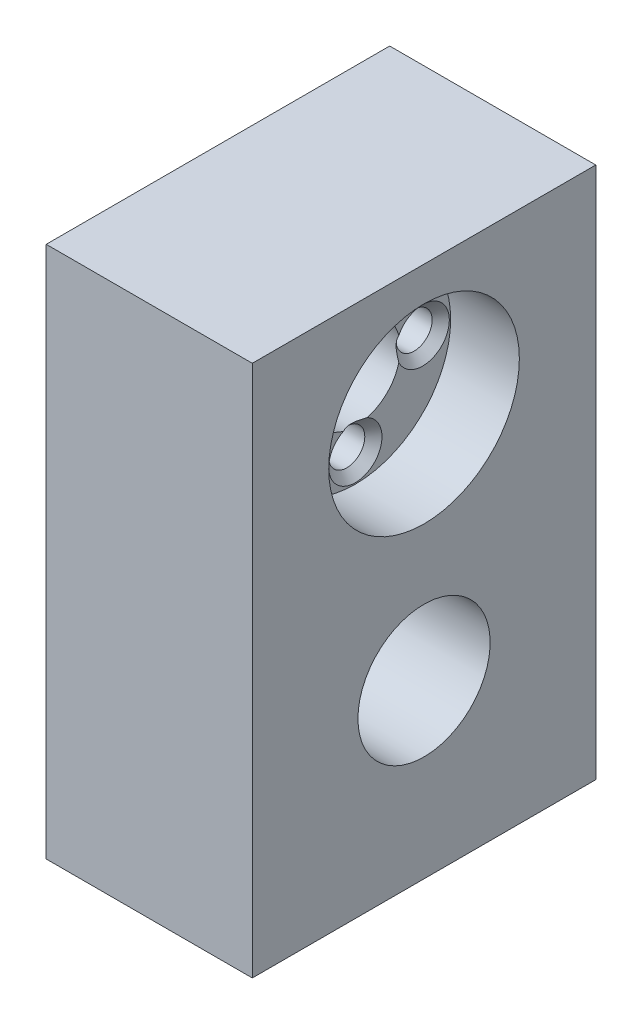
ISO-10303-21;
HEADER;
FILE_DESCRIPTION(('STEP AP214'),'2;1');
FILE_NAME('part.step','',(''),(''),'','','');
FILE_SCHEMA(('AUTOMOTIVE_DESIGN { 1 0 10303 214 1 1 1 1 }'));
ENDSEC;
DATA;
#1=APPLICATION_CONTEXT('core data for automotive mechanical design processes');
#2=APPLICATION_PROTOCOL_DEFINITION('international standard','automotive_design',2000,#1);
#3=PRODUCT_CONTEXT('',#1,'mechanical');
#4=PRODUCT('Part','Part','',(#3));
#5=PRODUCT_RELATED_PRODUCT_CATEGORY('part','',(#4));
#6=PRODUCT_DEFINITION_FORMATION('','',#4);
#7=PRODUCT_DEFINITION_CONTEXT('part definition',#1,'design');
#8=PRODUCT_DEFINITION('design','',#6,#7);
#9=PRODUCT_DEFINITION_SHAPE('','',#8);
#10=(LENGTH_UNIT() NAMED_UNIT(*) SI_UNIT(.MILLI.,.METRE.));
#11=(NAMED_UNIT(*) PLANE_ANGLE_UNIT() SI_UNIT($,.RADIAN.));
#12=(NAMED_UNIT(*) SI_UNIT($,.STERADIAN.) SOLID_ANGLE_UNIT());
#13=UNCERTAINTY_MEASURE_WITH_UNIT(LENGTH_MEASURE(1.E-05),#10,'distance_accuracy_value','');
#14=(GEOMETRIC_REPRESENTATION_CONTEXT(3) GLOBAL_UNCERTAINTY_ASSIGNED_CONTEXT((#13)) GLOBAL_UNIT_ASSIGNED_CONTEXT((#10,
#11,#12)) REPRESENTATION_CONTEXT('',''));
#15=CARTESIAN_POINT('',(0.,0.,0.));
#16=DIRECTION('',(0.,0.,1.));
#17=DIRECTION('',(1.,0.,0.));
#18=AXIS2_PLACEMENT_3D('',#15,#16,#17);
#19=CARTESIAN_POINT('',(-12.,62.,20.));
#20=DIRECTION('',(0.,0.,-1.));
#21=DIRECTION('',(-1.,0.,0.));
#22=AXIS2_PLACEMENT_3D('',#19,#20,#21);
#23=PLANE('',#22);
#24=DIRECTION('',(1.,0.,0.));
#25=VECTOR('',#24,1.);
#26=CARTESIAN_POINT('',(-12.,0.,20.));
#27=LINE('',#26,#25);
#28=CARTESIAN_POINT('',(-12.,0.,20.));
#29=VERTEX_POINT('',#28);
#30=CARTESIAN_POINT('',(12.,0.,20.));
#31=VERTEX_POINT('',#30);
#32=EDGE_CURVE('E153',#29,#31,#27,.T.);
#33=ORIENTED_EDGE('',*,*,#32,.T.);
#34=DIRECTION('',(0.,-1.,0.));
#35=VECTOR('',#34,1.);
#36=CARTESIAN_POINT('',(12.,62.,20.));
#37=LINE('',#36,#35);
#38=CARTESIAN_POINT('',(12.,62.,20.));
#39=VERTEX_POINT('',#38);
#40=EDGE_CURVE('E132',#39,#31,#37,.T.);
#41=ORIENTED_EDGE('',*,*,#40,.F.);
#42=DIRECTION('',(1.,0.,0.));
#43=VECTOR('',#42,1.);
#44=CARTESIAN_POINT('',(-12.,62.,20.));
#45=LINE('',#44,#43);
#46=CARTESIAN_POINT('',(-12.,62.,20.));
#47=VERTEX_POINT('',#46);
#48=EDGE_CURVE('E140',#47,#39,#45,.T.);
#49=ORIENTED_EDGE('',*,*,#48,.F.);
#50=DIRECTION('',(0.,-1.,0.));
#51=VECTOR('',#50,1.);
#52=CARTESIAN_POINT('',(-12.,62.,20.));
#53=LINE('',#52,#51);
#54=EDGE_CURVE('E365',#47,#29,#53,.T.);
#55=ORIENTED_EDGE('',*,*,#54,.T.);
#56=EDGE_LOOP('',(#33,#41,#49,#55));
#57=FACE_BOUND('',#56,.T.);
#58=ADVANCED_FACE('F42',(#57),#23,.F.);
#59=CARTESIAN_POINT('',(12.,62.,20.));
#60=DIRECTION('',(-1.,0.,0.));
#61=DIRECTION('',(0.,0.,1.));
#62=AXIS2_PLACEMENT_3D('',#59,#60,#61);
#63=PLANE('',#62);
#64=CARTESIAN_POINT('',(12.,46.9,0.));
#65=DIRECTION('',(1.,0.,0.));
#66=DIRECTION('',(0.,0.,-1.));
#67=AXIS2_PLACEMENT_3D('',#64,#65,#66);
#68=CIRCLE('',#67,11.1);
#69=CARTESIAN_POINT('',(12.,46.9,-11.1));
#70=VERTEX_POINT('',#69);
#71=EDGE_CURVE('E343',#70,#70,#68,.T.);
#72=ORIENTED_EDGE('',*,*,#71,.F.);
#73=EDGE_LOOP('',(#72));
#74=FACE_BOUND('',#73,.T.);
#75=CARTESIAN_POINT('',(12.,20.,0.));
#76=DIRECTION('',(-1.,0.,0.));
#77=DIRECTION('',(0.,0.,1.));
#78=AXIS2_PLACEMENT_3D('',#75,#76,#77);
#79=CIRCLE('',#78,7.7);
#80=CARTESIAN_POINT('',(12.,20.,7.7));
#81=VERTEX_POINT('',#80);
#82=EDGE_CURVE('E167',#81,#81,#79,.T.);
#83=ORIENTED_EDGE('',*,*,#82,.T.);
#84=EDGE_LOOP('',(#83));
#85=FACE_BOUND('',#84,.T.);
#86=DIRECTION('',(0.,0.,-1.));
#87=VECTOR('',#86,1.);
#88=CARTESIAN_POINT('',(12.,0.,20.));
#89=LINE('',#88,#87);
#90=CARTESIAN_POINT('',(12.,0.,-20.));
#91=VERTEX_POINT('',#90);
#92=EDGE_CURVE('E367',#31,#91,#89,.T.);
#93=ORIENTED_EDGE('',*,*,#92,.T.);
#94=DIRECTION('',(0.,-1.,0.));
#95=VECTOR('',#94,1.);
#96=CARTESIAN_POINT('',(12.,62.,-20.));
#97=LINE('',#96,#95);
#98=CARTESIAN_POINT('',(12.,62.,-20.));
#99=VERTEX_POINT('',#98);
#100=EDGE_CURVE('E135',#99,#91,#97,.T.);
#101=ORIENTED_EDGE('',*,*,#100,.F.);
#102=DIRECTION('',(0.,0.,-1.));
#103=VECTOR('',#102,1.);
#104=CARTESIAN_POINT('',(12.,62.,20.));
#105=LINE('',#104,#103);
#106=EDGE_CURVE('E128',#39,#99,#105,.T.);
#107=ORIENTED_EDGE('',*,*,#106,.F.);
#108=ORIENTED_EDGE('',*,*,#40,.T.);
#109=EDGE_LOOP('',(#93,#101,#107,#108));
#110=FACE_BOUND('',#109,.T.);
#111=ADVANCED_FACE('F130',(#74,#85,#110),#63,.F.);
#112=CARTESIAN_POINT('',(-12.,62.,-20.));
#113=DIRECTION('',(0.,0.,1.));
#114=DIRECTION('',(1.,0.,0.));
#115=AXIS2_PLACEMENT_3D('',#112,#113,#114);
#116=PLANE('',#115);
#117=DIRECTION('',(-1.,0.,0.));
#118=VECTOR('',#117,1.);
#119=CARTESIAN_POINT('',(-12.,0.,-20.));
#120=LINE('',#119,#118);
#121=CARTESIAN_POINT('',(-12.,0.,-20.));
#122=VERTEX_POINT('',#121);
#123=EDGE_CURVE('E370',#91,#122,#120,.T.);
#124=ORIENTED_EDGE('',*,*,#123,.T.);
#125=DIRECTION('',(0.,-1.,0.));
#126=VECTOR('',#125,1.);
#127=CARTESIAN_POINT('',(-12.,62.,-20.));
#128=LINE('',#127,#126);
#129=CARTESIAN_POINT('',(-12.,62.,-20.));
#130=VERTEX_POINT('',#129);
#131=EDGE_CURVE('E163',#130,#122,#128,.T.);
#132=ORIENTED_EDGE('',*,*,#131,.F.);
#133=DIRECTION('',(-1.,0.,0.));
#134=VECTOR('',#133,1.);
#135=CARTESIAN_POINT('',(-12.,62.,-20.));
#136=LINE('',#135,#134);
#137=EDGE_CURVE('E139',#99,#130,#136,.T.);
#138=ORIENTED_EDGE('',*,*,#137,.F.);
#139=ORIENTED_EDGE('',*,*,#100,.T.);
#140=EDGE_LOOP('',(#124,#132,#138,#139));
#141=FACE_BOUND('',#140,.T.);
#142=ADVANCED_FACE('F279',(#141),#116,.F.);
#143=CARTESIAN_POINT('',(-12.,62.,20.));
#144=DIRECTION('',(1.,0.,0.));
#145=DIRECTION('',(0.,0.,-1.));
#146=AXIS2_PLACEMENT_3D('',#143,#144,#145);
#147=PLANE('',#146);
#148=CARTESIAN_POINT('',(-12.,46.9,0.));
#149=DIRECTION('',(1.,0.,0.));
#150=DIRECTION('',(0.,0.,-1.));
#151=AXIS2_PLACEMENT_3D('',#148,#149,#150);
#152=CIRCLE('',#151,4.2);
#153=CARTESIAN_POINT('',(-12.,46.9,-4.2));
#154=VERTEX_POINT('',#153);
#155=EDGE_CURVE('E469',#154,#154,#152,.F.);
#156=ORIENTED_EDGE('',*,*,#155,.F.);
#157=EDGE_LOOP('',(#156));
#158=FACE_BOUND('',#157,.T.);
#159=CARTESIAN_POINT('',(-12.,20.,0.));
#160=DIRECTION('',(-1.,0.,0.));
#161=DIRECTION('',(0.,0.,1.));
#162=AXIS2_PLACEMENT_3D('',#159,#160,#161);
#163=CIRCLE('',#162,16.2);
#164=CARTESIAN_POINT('',(-12.,20.,16.2));
#165=VERTEX_POINT('',#164);
#166=EDGE_CURVE('E170',#165,#165,#163,.T.);
#167=ORIENTED_EDGE('',*,*,#166,.F.);
#168=EDGE_LOOP('',(#167));
#169=FACE_BOUND('',#168,.T.);
#170=DIRECTION('',(0.,0.,1.));
#171=VECTOR('',#170,1.);
#172=CARTESIAN_POINT('',(-12.,0.,20.));
#173=LINE('',#172,#171);
#174=EDGE_CURVE('E150',#122,#29,#173,.T.);
#175=ORIENTED_EDGE('',*,*,#174,.T.);
#176=ORIENTED_EDGE('',*,*,#54,.F.);
#177=DIRECTION('',(0.,0.,1.));
#178=VECTOR('',#177,1.);
#179=CARTESIAN_POINT('',(-12.,62.,20.));
#180=LINE('',#179,#178);
#181=EDGE_CURVE('E145',#130,#47,#180,.T.);
#182=ORIENTED_EDGE('',*,*,#181,.F.);
#183=ORIENTED_EDGE('',*,*,#131,.T.);
#184=EDGE_LOOP('',(#175,#176,#182,#183));
#185=FACE_BOUND('',#184,.T.);
#186=ADVANCED_FACE('F382',(#158,#169,#185),#147,.F.);
#187=CARTESIAN_POINT('',(0.,62.,0.));
#188=DIRECTION('',(0.,1.,0.));
#189=DIRECTION('',(0.,0.,1.));
#190=AXIS2_PLACEMENT_3D('',#187,#188,#189);
#191=PLANE('',#190);
#192=ORIENTED_EDGE('',*,*,#48,.T.);
#193=ORIENTED_EDGE('',*,*,#106,.T.);
#194=ORIENTED_EDGE('',*,*,#137,.T.);
#195=ORIENTED_EDGE('',*,*,#181,.T.);
#196=EDGE_LOOP('',(#192,#193,#194,#195));
#197=FACE_BOUND('',#196,.T.);
#198=ADVANCED_FACE('F143',(#197),#191,.T.);
#199=CARTESIAN_POINT('',(0.,0.,0.));
#200=DIRECTION('',(0.,1.,0.));
#201=DIRECTION('',(0.,0.,1.));
#202=AXIS2_PLACEMENT_3D('',#199,#200,#201);
#203=PLANE('',#202);
#204=ORIENTED_EDGE('',*,*,#32,.F.);
#205=ORIENTED_EDGE('',*,*,#174,.F.);
#206=ORIENTED_EDGE('',*,*,#123,.F.);
#207=ORIENTED_EDGE('',*,*,#92,.F.);
#208=EDGE_LOOP('',(#204,#205,#206,#207));
#209=FACE_BOUND('',#208,.T.);
#210=ADVANCED_FACE('F386',(#209),#203,.F.);
#211=CARTESIAN_POINT('',(-7.,20.,0.));
#212=DIRECTION('',(-1.,0.,0.));
#213=DIRECTION('',(0.,0.,1.));
#214=AXIS2_PLACEMENT_3D('',#211,#212,#213);
#215=CYLINDRICAL_SURFACE('',#214,16.2);
#216=CARTESIAN_POINT('',(-7.,20.,0.));
#217=DIRECTION('',(-1.,0.,0.));
#218=DIRECTION('',(0.,0.,1.));
#219=AXIS2_PLACEMENT_3D('',#216,#217,#218);
#220=CIRCLE('',#219,16.2);
#221=CARTESIAN_POINT('',(-7.,20.,16.2));
#222=VERTEX_POINT('',#221);
#223=EDGE_CURVE('E354',#222,#222,#220,.T.);
#224=ORIENTED_EDGE('',*,*,#223,.F.);
#225=EDGE_LOOP('',(#224));
#226=FACE_BOUND('',#225,.T.);
#227=ORIENTED_EDGE('',*,*,#166,.T.);
#228=EDGE_LOOP('',(#227));
#229=FACE_BOUND('',#228,.T.);
#230=ADVANCED_FACE('F396',(#226,#229),#215,.F.);
#231=CARTESIAN_POINT('',(-7.,20.,0.));
#232=DIRECTION('',(-1.,0.,0.));
#233=DIRECTION('',(0.,0.,1.));
#234=AXIS2_PLACEMENT_3D('',#231,#232,#233);
#235=PLANE('',#234);
#236=CARTESIAN_POINT('',(-7.,20.0000000000001,11.95));
#237=DIRECTION('',(-1.,0.,0.));
#238=DIRECTION('',(0.,0.,1.));
#239=AXIS2_PLACEMENT_3D('',#236,#237,#238);
#240=CIRCLE('',#239,3.1);
#241=CARTESIAN_POINT('',(-7.,20.0000000000001,15.05));
#242=VERTEX_POINT('',#241);
#243=EDGE_CURVE('E195',#242,#242,#240,.F.);
#244=ORIENTED_EDGE('',*,*,#243,.T.);
#245=EDGE_LOOP('',(#244));
#246=FACE_BOUND('',#245,.T.);
#247=CARTESIAN_POINT('',(-7.,8.05,0.));
#248=DIRECTION('',(-1.,0.,0.));
#249=DIRECTION('',(0.,0.,1.));
#250=AXIS2_PLACEMENT_3D('',#247,#248,#249);
#251=CIRCLE('',#250,3.1);
#252=CARTESIAN_POINT('',(-7.,8.05,3.1));
#253=VERTEX_POINT('',#252);
#254=EDGE_CURVE('E188',#253,#253,#251,.F.);
#255=ORIENTED_EDGE('',*,*,#254,.T.);
#256=EDGE_LOOP('',(#255));
#257=FACE_BOUND('',#256,.T.);
#258=CARTESIAN_POINT('',(-7.,20.,-11.95));
#259=DIRECTION('',(-1.,0.,0.));
#260=DIRECTION('',(0.,0.,1.));
#261=AXIS2_PLACEMENT_3D('',#258,#259,#260);
#262=CIRCLE('',#261,3.1);
#263=CARTESIAN_POINT('',(-7.,20.,-8.85));
#264=VERTEX_POINT('',#263);
#265=EDGE_CURVE('E180',#264,#264,#262,.F.);
#266=ORIENTED_EDGE('',*,*,#265,.T.);
#267=EDGE_LOOP('',(#266));
#268=FACE_BOUND('',#267,.T.);
#269=CARTESIAN_POINT('',(-7.,31.95,0.));
#270=DIRECTION('',(-1.,0.,0.));
#271=DIRECTION('',(0.,0.,1.));
#272=AXIS2_PLACEMENT_3D('',#269,#270,#271);
#273=CIRCLE('',#272,3.1);
#274=CARTESIAN_POINT('',(-7.,31.95,3.1));
#275=VERTEX_POINT('',#274);
#276=EDGE_CURVE('E160',#275,#275,#273,.F.);
#277=ORIENTED_EDGE('',*,*,#276,.T.);
#278=EDGE_LOOP('',(#277));
#279=FACE_BOUND('',#278,.T.);
#280=CARTESIAN_POINT('',(-7.,20.,0.));
#281=DIRECTION('',(-1.,0.,0.));
#282=DIRECTION('',(0.,0.,1.));
#283=AXIS2_PLACEMENT_3D('',#280,#281,#282);
#284=CIRCLE('',#283,7.7);
#285=CARTESIAN_POINT('',(-7.,20.,7.7));
#286=VERTEX_POINT('',#285);
#287=EDGE_CURVE('E171',#286,#286,#284,.T.);
#288=ORIENTED_EDGE('',*,*,#287,.F.);
#289=EDGE_LOOP('',(#288));
#290=FACE_BOUND('',#289,.T.);
#291=ORIENTED_EDGE('',*,*,#223,.T.);
#292=EDGE_LOOP('',(#291));
#293=FACE_BOUND('',#292,.T.);
#294=ADVANCED_FACE('F401',(#246,#257,#268,#279,#290,#293),#235,.T.);
#295=CARTESIAN_POINT('',(18.,20.,0.));
#296=DIRECTION('',(-1.,0.,0.));
#297=DIRECTION('',(0.,0.,1.));
#298=AXIS2_PLACEMENT_3D('',#295,#296,#297);
#299=CYLINDRICAL_SURFACE('',#298,7.7);
#300=ORIENTED_EDGE('',*,*,#287,.T.);
#301=EDGE_LOOP('',(#300));
#302=FACE_BOUND('',#301,.T.);
#303=ORIENTED_EDGE('',*,*,#82,.F.);
#304=EDGE_LOOP('',(#303));
#305=FACE_BOUND('',#304,.T.);
#306=ADVANCED_FACE('F405',(#302,#305),#299,.F.);
#307=CARTESIAN_POINT('',(-1.,31.95,0.));
#308=DIRECTION('',(-1.,0.,0.));
#309=DIRECTION('',(0.,0.,1.));
#310=AXIS2_PLACEMENT_3D('',#307,#308,#309);
#311=CYLINDRICAL_SURFACE('',#310,2.1);
#312=CARTESIAN_POINT('',(-6.00000000000001,31.95,0.));
#313=DIRECTION('',(-1.,0.,0.));
#314=DIRECTION('',(0.,0.,1.));
#315=AXIS2_PLACEMENT_3D('',#312,#313,#314);
#316=CIRCLE('',#315,2.1);
#317=CARTESIAN_POINT('',(-6.00000000000001,31.95,2.1));
#318=VERTEX_POINT('',#317);
#319=EDGE_CURVE('E155',#318,#318,#316,.T.);
#320=ORIENTED_EDGE('',*,*,#319,.T.);
#321=EDGE_LOOP('',(#320));
#322=FACE_BOUND('',#321,.T.);
#323=CARTESIAN_POINT('',(-1.,31.95,0.));
#324=DIRECTION('',(-1.,0.,0.));
#325=DIRECTION('',(0.,0.,1.));
#326=AXIS2_PLACEMENT_3D('',#323,#324,#325);
#327=CIRCLE('',#326,2.1);
#328=CARTESIAN_POINT('',(-1.,31.95,2.1));
#329=VERTEX_POINT('',#328);
#330=EDGE_CURVE('E347',#329,#329,#327,.T.);
#331=ORIENTED_EDGE('',*,*,#330,.F.);
#332=EDGE_LOOP('',(#331));
#333=FACE_BOUND('',#332,.T.);
#334=ADVANCED_FACE('F409',(#322,#333),#311,.F.);
#335=CARTESIAN_POINT('',(-1.,31.95,0.));
#336=DIRECTION('',(-1.,0.,0.));
#337=DIRECTION('',(0.,0.,1.));
#338=AXIS2_PLACEMENT_3D('',#335,#336,#337);
#339=PLANE('',#338);
#340=ORIENTED_EDGE('',*,*,#330,.T.);
#341=EDGE_LOOP('',(#340));
#342=FACE_BOUND('',#341,.T.);
#343=ADVANCED_FACE('F292',(#342),#339,.T.);
#344=CARTESIAN_POINT('',(-6.00000000000001,31.95,0.));
#345=DIRECTION('',(-1.,0.,0.));
#346=DIRECTION('',(0.,0.,1.));
#347=AXIS2_PLACEMENT_3D('',#344,#345,#346);
#348=CONICAL_SURFACE('',#347,2.1,0.785398163397452);
#349=ORIENTED_EDGE('',*,*,#276,.F.);
#350=EDGE_LOOP('',(#349));
#351=FACE_BOUND('',#350,.T.);
#352=ORIENTED_EDGE('',*,*,#319,.F.);
#353=EDGE_LOOP('',(#352));
#354=FACE_BOUND('',#353,.T.);
#355=ADVANCED_FACE('F285',(#351,#354),#348,.F.);
#356=CARTESIAN_POINT('',(-1.,20.0000000000001,11.95));
#357=DIRECTION('',(-1.,0.,0.));
#358=DIRECTION('',(0.,0.,1.));
#359=AXIS2_PLACEMENT_3D('',#356,#357,#358);
#360=CYLINDRICAL_SURFACE('',#359,2.1);
#361=CARTESIAN_POINT('',(-6.00000000000001,20.0000000000001,11.95));
#362=DIRECTION('',(-1.,0.,0.));
#363=DIRECTION('',(0.,0.,1.));
#364=AXIS2_PLACEMENT_3D('',#361,#362,#363);
#365=CIRCLE('',#364,2.1);
#366=CARTESIAN_POINT('',(-6.00000000000001,20.0000000000001,14.05));
#367=VERTEX_POINT('',#366);
#368=EDGE_CURVE('E192',#367,#367,#365,.T.);
#369=ORIENTED_EDGE('',*,*,#368,.T.);
#370=EDGE_LOOP('',(#369));
#371=FACE_BOUND('',#370,.T.);
#372=CARTESIAN_POINT('',(-1.,20.0000000000001,11.95));
#373=DIRECTION('',(-1.,0.,0.));
#374=DIRECTION('',(0.,-1.,0.));
#375=AXIS2_PLACEMENT_3D('',#372,#373,#374);
#376=CIRCLE('',#375,2.1);
#377=CARTESIAN_POINT('',(-1.,17.9000000000001,11.95));
#378=VERTEX_POINT('',#377);
#379=EDGE_CURVE('E330',#378,#378,#376,.T.);
#380=ORIENTED_EDGE('',*,*,#379,.F.);
#381=EDGE_LOOP('',(#380));
#382=FACE_BOUND('',#381,.T.);
#383=ADVANCED_FACE('F291',(#371,#382),#360,.F.);
#384=CARTESIAN_POINT('',(-1.,20.0000000000001,11.95));
#385=DIRECTION('',(-1.,0.,0.));
#386=DIRECTION('',(0.,-1.,0.));
#387=AXIS2_PLACEMENT_3D('',#384,#385,#386);
#388=PLANE('',#387);
#389=ORIENTED_EDGE('',*,*,#379,.T.);
#390=EDGE_LOOP('',(#389));
#391=FACE_BOUND('',#390,.T.);
#392=ADVANCED_FACE('F326',(#391),#388,.T.);
#393=CARTESIAN_POINT('',(-1.,8.05,0.));
#394=DIRECTION('',(-1.,0.,0.));
#395=DIRECTION('',(0.,0.,1.));
#396=AXIS2_PLACEMENT_3D('',#393,#394,#395);
#397=CYLINDRICAL_SURFACE('',#396,2.1);
#398=CARTESIAN_POINT('',(-6.00000000000001,8.05,0.));
#399=DIRECTION('',(-1.,0.,0.));
#400=DIRECTION('',(0.,0.,1.));
#401=AXIS2_PLACEMENT_3D('',#398,#399,#400);
#402=CIRCLE('',#401,2.1);
#403=CARTESIAN_POINT('',(-6.00000000000001,8.05,2.1));
#404=VERTEX_POINT('',#403);
#405=EDGE_CURVE('E184',#404,#404,#402,.T.);
#406=ORIENTED_EDGE('',*,*,#405,.T.);
#407=EDGE_LOOP('',(#406));
#408=FACE_BOUND('',#407,.T.);
#409=CARTESIAN_POINT('',(-1.,8.05,0.));
#410=DIRECTION('',(-1.,0.,0.));
#411=DIRECTION('',(0.,0.,-1.));
#412=AXIS2_PLACEMENT_3D('',#409,#410,#411);
#413=CIRCLE('',#412,2.1);
#414=CARTESIAN_POINT('',(-1.,8.05,-2.1));
#415=VERTEX_POINT('',#414);
#416=EDGE_CURVE('E333',#415,#415,#413,.T.);
#417=ORIENTED_EDGE('',*,*,#416,.F.);
#418=EDGE_LOOP('',(#417));
#419=FACE_BOUND('',#418,.T.);
#420=ADVANCED_FACE('F419',(#408,#419),#397,.F.);
#421=CARTESIAN_POINT('',(-1.,8.05,0.));
#422=DIRECTION('',(-1.,0.,0.));
#423=DIRECTION('',(0.,0.,-1.));
#424=AXIS2_PLACEMENT_3D('',#421,#422,#423);
#425=PLANE('',#424);
#426=ORIENTED_EDGE('',*,*,#416,.T.);
#427=EDGE_LOOP('',(#426));
#428=FACE_BOUND('',#427,.T.);
#429=ADVANCED_FACE('F422',(#428),#425,.T.);
#430=CARTESIAN_POINT('',(-1.,20.,-11.95));
#431=DIRECTION('',(-1.,0.,0.));
#432=DIRECTION('',(0.,0.,1.));
#433=AXIS2_PLACEMENT_3D('',#430,#431,#432);
#434=CYLINDRICAL_SURFACE('',#433,2.1);
#435=CARTESIAN_POINT('',(-6.00000000000001,20.,-11.95));
#436=DIRECTION('',(-1.,0.,0.));
#437=DIRECTION('',(0.,0.,1.));
#438=AXIS2_PLACEMENT_3D('',#435,#436,#437);
#439=CIRCLE('',#438,2.1);
#440=CARTESIAN_POINT('',(-6.00000000000001,20.,-9.85));
#441=VERTEX_POINT('',#440);
#442=EDGE_CURVE('E176',#441,#441,#439,.T.);
#443=ORIENTED_EDGE('',*,*,#442,.T.);
#444=EDGE_LOOP('',(#443));
#445=FACE_BOUND('',#444,.T.);
#446=CARTESIAN_POINT('',(-1.,20.,-11.95));
#447=DIRECTION('',(-1.,0.,0.));
#448=DIRECTION('',(0.,1.,0.));
#449=AXIS2_PLACEMENT_3D('',#446,#447,#448);
#450=CIRCLE('',#449,2.1);
#451=CARTESIAN_POINT('',(-1.,22.1,-11.95));
#452=VERTEX_POINT('',#451);
#453=EDGE_CURVE('E339',#452,#452,#450,.T.);
#454=ORIENTED_EDGE('',*,*,#453,.F.);
#455=EDGE_LOOP('',(#454));
#456=FACE_BOUND('',#455,.T.);
#457=ADVANCED_FACE('F426',(#445,#456),#434,.F.);
#458=CARTESIAN_POINT('',(-1.,20.,-11.95));
#459=DIRECTION('',(-1.,0.,0.));
#460=DIRECTION('',(0.,1.,0.));
#461=AXIS2_PLACEMENT_3D('',#458,#459,#460);
#462=PLANE('',#461);
#463=ORIENTED_EDGE('',*,*,#453,.T.);
#464=EDGE_LOOP('',(#463));
#465=FACE_BOUND('',#464,.T.);
#466=ADVANCED_FACE('F301',(#465),#462,.T.);
#467=CARTESIAN_POINT('',(-6.00000000000001,20.,-11.95));
#468=DIRECTION('',(-1.,0.,0.));
#469=DIRECTION('',(0.,0.,1.));
#470=AXIS2_PLACEMENT_3D('',#467,#468,#469);
#471=CONICAL_SURFACE('',#470,2.1,0.785398163397452);
#472=ORIENTED_EDGE('',*,*,#265,.F.);
#473=EDGE_LOOP('',(#472));
#474=FACE_BOUND('',#473,.T.);
#475=ORIENTED_EDGE('',*,*,#442,.F.);
#476=EDGE_LOOP('',(#475));
#477=FACE_BOUND('',#476,.T.);
#478=ADVANCED_FACE('F294',(#474,#477),#471,.F.);
#479=CARTESIAN_POINT('',(-6.00000000000001,8.05,0.));
#480=DIRECTION('',(-1.,0.,0.));
#481=DIRECTION('',(0.,0.,1.));
#482=AXIS2_PLACEMENT_3D('',#479,#480,#481);
#483=CONICAL_SURFACE('',#482,2.1,0.785398163397452);
#484=ORIENTED_EDGE('',*,*,#254,.F.);
#485=EDGE_LOOP('',(#484));
#486=FACE_BOUND('',#485,.T.);
#487=ORIENTED_EDGE('',*,*,#405,.F.);
#488=EDGE_LOOP('',(#487));
#489=FACE_BOUND('',#488,.T.);
#490=ADVANCED_FACE('F300',(#486,#489),#483,.F.);
#491=CARTESIAN_POINT('',(-6.00000000000001,20.0000000000001,11.95));
#492=DIRECTION('',(-1.,0.,0.));
#493=DIRECTION('',(0.,0.,1.));
#494=AXIS2_PLACEMENT_3D('',#491,#492,#493);
#495=CONICAL_SURFACE('',#494,2.1,0.785398163397452);
#496=ORIENTED_EDGE('',*,*,#243,.F.);
#497=EDGE_LOOP('',(#496));
#498=FACE_BOUND('',#497,.T.);
#499=ORIENTED_EDGE('',*,*,#368,.F.);
#500=EDGE_LOOP('',(#499));
#501=FACE_BOUND('',#500,.T.);
#502=ADVANCED_FACE('F307',(#498,#501),#495,.F.);
#503=CARTESIAN_POINT('',(4.,46.9,0.));
#504=DIRECTION('',(1.,0.,0.));
#505=DIRECTION('',(0.,0.,-1.));
#506=AXIS2_PLACEMENT_3D('',#503,#504,#505);
#507=CYLINDRICAL_SURFACE('',#506,11.1);
#508=CARTESIAN_POINT('',(4.,46.9,0.));
#509=DIRECTION('',(1.,0.,0.));
#510=DIRECTION('',(0.,0.,-1.));
#511=AXIS2_PLACEMENT_3D('',#508,#509,#510);
#512=CIRCLE('',#511,11.1);
#513=CARTESIAN_POINT('',(4.,46.9,-11.1));
#514=VERTEX_POINT('',#513);
#515=EDGE_CURVE('E334',#514,#514,#512,.T.);
#516=ORIENTED_EDGE('',*,*,#515,.F.);
#517=EDGE_LOOP('',(#516));
#518=FACE_BOUND('',#517,.T.);
#519=ORIENTED_EDGE('',*,*,#71,.T.);
#520=EDGE_LOOP('',(#519));
#521=FACE_BOUND('',#520,.T.);
#522=ADVANCED_FACE('F312',(#518,#521),#507,.F.);
#523=CARTESIAN_POINT('',(4.,46.9,0.));
#524=DIRECTION('',(1.,0.,0.));
#525=DIRECTION('',(0.,0.,-1.));
#526=AXIS2_PLACEMENT_3D('',#523,#524,#525);
#527=PLANE('',#526);
#528=CARTESIAN_POINT('',(4.,46.9,0.));
#529=DIRECTION('',(1.,0.,0.));
#530=DIRECTION('',(0.,0.,-1.));
#531=AXIS2_PLACEMENT_3D('',#528,#529,#530);
#532=CIRCLE('',#531,5.25);
#533=CARTESIAN_POINT('',(4.,48.2748282128982,-5.06678866591248));
#534=VERTEX_POINT('',#533);
#535=CARTESIAN_POINT('',(4.,51.9667886659125,-1.37482821289813));
#536=VERTEX_POINT('',#535);
#537=EDGE_CURVE('E440',#534,#536,#532,.T.);
#538=ORIENTED_EDGE('',*,*,#537,.F.);
#539=CARTESIAN_POINT('',(4.,46.9000000000001,-7.84525));
#540=DIRECTION('',(1.,0.,0.));
#541=DIRECTION('',(0.,0.,-1.));
#542=AXIS2_PLACEMENT_3D('',#539,#540,#541);
#543=CIRCLE('',#542,3.1);
#544=CARTESIAN_POINT('',(4.,45.5251717871019,-5.06678866591251));
#545=VERTEX_POINT('',#544);
#546=EDGE_CURVE('E58',#534,#545,#543,.F.);
#547=ORIENTED_EDGE('',*,*,#546,.T.);
#548=CARTESIAN_POINT('',(4.,41.8332113340875,-1.37482821289811));
#549=VERTEX_POINT('',#548);
#550=EDGE_CURVE('E480',#549,#545,#532,.T.);
#551=ORIENTED_EDGE('',*,*,#550,.F.);
#552=CARTESIAN_POINT('',(4.,39.05475,0.));
#553=DIRECTION('',(1.,0.,0.));
#554=DIRECTION('',(0.,0.,-1.));
#555=AXIS2_PLACEMENT_3D('',#552,#553,#554);
#556=CIRCLE('',#555,3.09999999999999);
#557=CARTESIAN_POINT('',(4.,41.8332113340875,1.37482821289812));
#558=VERTEX_POINT('',#557);
#559=EDGE_CURVE('E251',#549,#558,#556,.F.);
#560=ORIENTED_EDGE('',*,*,#559,.T.);
#561=CARTESIAN_POINT('',(4.,45.5251717871019,5.0667886659125));
#562=VERTEX_POINT('',#561);
#563=EDGE_CURVE('E478',#562,#558,#532,.T.);
#564=ORIENTED_EDGE('',*,*,#563,.F.);
#565=CARTESIAN_POINT('',(4.,46.9,7.84525));
#566=DIRECTION('',(1.,0.,0.));
#567=DIRECTION('',(0.,0.,-1.));
#568=AXIS2_PLACEMENT_3D('',#565,#566,#567);
#569=CIRCLE('',#568,3.09999999999998);
#570=CARTESIAN_POINT('',(4.,48.2748282128981,5.06678866591251));
#571=VERTEX_POINT('',#570);
#572=EDGE_CURVE('E464',#562,#571,#569,.F.);
#573=ORIENTED_EDGE('',*,*,#572,.T.);
#574=CARTESIAN_POINT('',(4.,51.9667886659125,1.37482821289813));
#575=VERTEX_POINT('',#574);
#576=EDGE_CURVE('E449',#575,#571,#532,.T.);
#577=ORIENTED_EDGE('',*,*,#576,.F.);
#578=CARTESIAN_POINT('',(4.,54.74525,0.));
#579=DIRECTION('',(1.,0.,0.));
#580=DIRECTION('',(0.,0.,-1.));
#581=AXIS2_PLACEMENT_3D('',#578,#579,#580);
#582=CIRCLE('',#581,3.1);
#583=EDGE_CURVE('E203',#575,#536,#582,.F.);
#584=ORIENTED_EDGE('',*,*,#583,.T.);
#585=EDGE_LOOP('',(#538,#547,#551,#560,#564,#573,#577,#584));
#586=FACE_BOUND('',#585,.T.);
#587=ORIENTED_EDGE('',*,*,#515,.T.);
#588=EDGE_LOOP('',(#587));
#589=FACE_BOUND('',#588,.T.);
#590=ADVANCED_FACE('F317',(#586,#589),#527,.T.);
#591=CARTESIAN_POINT('',(-6.02,46.9,0.));
#592=DIRECTION('',(-1.,0.,0.));
#593=DIRECTION('',(0.,0.,-1.));
#594=AXIS2_PLACEMENT_3D('',#591,#592,#593);
#595=PLANE('',#594);
#596=CARTESIAN_POINT('',(-6.02,46.9,0.));
#597=DIRECTION('',(1.,0.,0.));
#598=DIRECTION('',(0.,0.,-1.));
#599=AXIS2_PLACEMENT_3D('',#596,#597,#598);
#600=CIRCLE('',#599,4.2);
#601=CARTESIAN_POINT('',(-6.02,46.9,-4.2));
#602=VERTEX_POINT('',#601);
#603=EDGE_CURVE('E472',#602,#602,#600,.T.);
#604=ORIENTED_EDGE('',*,*,#603,.F.);
#605=EDGE_LOOP('',(#604));
#606=FACE_BOUND('',#605,.T.);
#607=CARTESIAN_POINT('',(-6.02,46.9,0.));
#608=DIRECTION('',(-1.,0.,0.));
#609=DIRECTION('',(0.,0.,1.));
#610=AXIS2_PLACEMENT_3D('',#607,#608,#609);
#611=CIRCLE('',#610,5.25);
#612=CARTESIAN_POINT('',(-6.02,46.9,5.25));
#613=VERTEX_POINT('',#612);
#614=EDGE_CURVE('E445',#613,#613,#611,.F.);
#615=ORIENTED_EDGE('',*,*,#614,.T.);
#616=EDGE_LOOP('',(#615));
#617=FACE_BOUND('',#616,.T.);
#618=ADVANCED_FACE('F228',(#606,#617),#595,.F.);
#619=CARTESIAN_POINT('',(-20.8692424049175,46.9,0.));
#620=DIRECTION('',(1.,0.,0.));
#621=DIRECTION('',(0.,0.,-1.));
#622=AXIS2_PLACEMENT_3D('',#619,#620,#621);
#623=CYLINDRICAL_SURFACE('',#622,5.25);
#624=ORIENTED_EDGE('',*,*,#550,.T.);
#625=CARTESIAN_POINT('',(4.,45.5251717871019,-5.06678866591251));
#626=CARTESIAN_POINT('',(3.95823284690607,45.5860550169876,-5.08330025762622));
#627=CARTESIAN_POINT('',(3.91772435418454,45.6481009482058,-5.09896564916981));
#628=CARTESIAN_POINT('',(3.84002193676327,45.7750037349017,-5.12846652850055));
#629=CARTESIAN_POINT('',(3.80284212704259,45.8398709737267,-5.14229433397041));
#630=CARTESIAN_POINT('',(3.7322266918256,45.9737810523574,-5.16810930869926));
#631=CARTESIAN_POINT('',(3.69888431379709,46.0428824789315,-5.18005253772903));
#632=CARTESIAN_POINT('',(3.63830231855732,46.1839720672682,-5.20143162320166));
#633=CARTESIAN_POINT('',(3.61105272546422,46.2559552792958,-5.21087158310002));
#634=CARTESIAN_POINT('',(3.55752631930077,46.4237196492293,-5.22920995993566));
#635=CARTESIAN_POINT('',(3.53373980966868,46.5204366850198,-5.23718737939147));
#636=CARTESIAN_POINT('',(3.50232818368798,46.7158977992734,-5.24767230647693));
#637=CARTESIAN_POINT('',(3.49454851297327,46.8146131086226,-5.25023213077088));
#638=CARTESIAN_POINT('',(3.49605413397679,47.0120914545459,-5.24973391260006));
#639=CARTESIAN_POINT('',(3.50537381808018,47.1108541869978,-5.24666454800377));
#640=CARTESIAN_POINT('',(3.53969100097991,47.3061724239792,-5.23519023222116));
#641=CARTESIAN_POINT('',(3.56484090928677,47.402696902829,-5.22673340214607));
#642=CARTESIAN_POINT('',(3.61975897498246,47.5676955620106,-5.20785881639051));
#643=CARTESIAN_POINT('',(3.64685891242525,47.6372171940171,-5.19843888162676));
#644=CARTESIAN_POINT('',(3.7066535989176,47.7735446430515,-5.17727537350991));
#645=CARTESIAN_POINT('',(3.7393563310116,47.840346414284,-5.1655284808478));
#646=CARTESIAN_POINT('',(3.80836229436338,47.9698788325814,-5.14024640258051));
#647=CARTESIAN_POINT('',(3.84457858788541,48.0326646970365,-5.12675253066883));
#648=CARTESIAN_POINT('',(3.92014108294206,48.155601775007,-5.09803027832956));
#649=CARTESIAN_POINT('',(3.9594756287854,48.2157616071518,-5.08280827306882));
#650=CARTESIAN_POINT('',(3.99999999999999,48.2748282128982,-5.06678866591248));
#651=B_SPLINE_CURVE_WITH_KNOTS('',3,(#625,#626,#627,#628,#629,#630,#631,#632,#633,#634,#635,
#636,#637,#638,#639,#640,#641,#642,#643,#644,#645,#646,#647,#648,#649,#650),.UNSPECIFIED.,.F.,
.F.,(4,2,2,2,2,2,2,2,2,2,2,2,4),(0.,0.227028391268089,0.454977901355169,0.687637839239411,
0.919914000771185,1.21838482831592,1.51395997698207,1.81013027559964,2.10919658257305,
2.33451393651725,2.56015504130512,2.78119864762828,3.00145180107783),.UNSPECIFIED.);
#652=EDGE_CURVE('E11',#545,#534,#651,.T.);
#653=ORIENTED_EDGE('',*,*,#652,.T.);
#654=ORIENTED_EDGE('',*,*,#537,.T.);
#655=CARTESIAN_POINT('',(4.,51.9667886659125,-1.37482821289813));
#656=CARTESIAN_POINT('',(3.95823284690607,51.9833002576262,-1.31394498301249));
#657=CARTESIAN_POINT('',(3.91772435418455,51.9989656491698,-1.25189905179427));
#658=CARTESIAN_POINT('',(3.84002193676327,52.0284665285005,-1.12499626509834));
#659=CARTESIAN_POINT('',(3.8028421270426,52.0422943339704,-1.06012902627339));
#660=CARTESIAN_POINT('',(3.7322266918256,52.0681093086992,-0.926218947642696));
#661=CARTESIAN_POINT('',(3.69888431379709,52.080052537729,-0.857117521068556));
#662=CARTESIAN_POINT('',(3.63830231855732,52.1014316232017,-0.716027932731841));
#663=CARTESIAN_POINT('',(3.61105272546422,52.1108715831,-0.644044720704264));
#664=CARTESIAN_POINT('',(3.55752631930077,52.1292099599357,-0.476280350770739));
#665=CARTESIAN_POINT('',(3.53373980966868,52.1371873793915,-0.379563314980273));
#666=CARTESIAN_POINT('',(3.50232818368798,52.1476723064769,-0.184102200726624));
#667=CARTESIAN_POINT('',(3.49454851297327,52.1502321307709,-0.0853868913774591));
#668=CARTESIAN_POINT('',(3.49605413397679,52.1497339126001,0.112091454545806));
#669=CARTESIAN_POINT('',(3.50537381808019,52.1466645480038,0.210854186997707));
#670=CARTESIAN_POINT('',(3.53969100097991,52.1351902322212,0.406172423979172));
#671=CARTESIAN_POINT('',(3.56484090928678,52.1267334021461,0.502696902828954));
#672=CARTESIAN_POINT('',(3.61975897498246,52.1078588163905,0.667695562010535));
#673=CARTESIAN_POINT('',(3.64685891242526,52.0984388816268,0.73721719401705));
#674=CARTESIAN_POINT('',(3.70665359891761,52.0772753735099,0.873544643051484));
#675=CARTESIAN_POINT('',(3.73935633101161,52.0655284808478,0.940346414283974));
#676=CARTESIAN_POINT('',(3.80836229436338,52.0402464025805,1.06987883258132));
#677=CARTESIAN_POINT('',(3.84457858788542,52.0267525306688,1.13266469703644));
#678=CARTESIAN_POINT('',(3.92014108294207,51.9980302783296,1.25560177500693));
#679=CARTESIAN_POINT('',(3.95947562878541,51.9828082730688,1.31576160715176));
#680=CARTESIAN_POINT('',(4.,51.9667886659125,1.37482821289813));
#681=B_SPLINE_CURVE_WITH_KNOTS('',3,(#655,#656,#657,#658,#659,#660,#661,#662,#663,#664,#665,
#666,#667,#668,#669,#670,#671,#672,#673,#674,#675,#676,#677,#678,#679,#680),.UNSPECIFIED.,.F.,
.F.,(4,2,2,2,2,2,2,2,2,2,2,2,4),(0.,0.227028391268091,0.454977901355171,0.687637839239407,
0.919914000771187,1.21838482831592,1.51395997698208,1.81013027559964,2.10919658257305,
2.33451393651725,2.56015504130512,2.78119864762829,3.00145180107783),.UNSPECIFIED.);
#682=EDGE_CURVE('E207',#536,#575,#681,.T.);
#683=ORIENTED_EDGE('',*,*,#682,.T.);
#684=ORIENTED_EDGE('',*,*,#576,.T.);
#685=CARTESIAN_POINT('',(4.,48.2748282128981,5.06678866591251));
#686=CARTESIAN_POINT('',(3.95823284690607,48.2139449830124,5.08330025762622));
#687=CARTESIAN_POINT('',(3.91772435418455,48.1518990517942,5.0989656491698));
#688=CARTESIAN_POINT('',(3.84002193676328,48.0249962650983,5.12846652850054));
#689=CARTESIAN_POINT('',(3.8028421270426,47.9601290262733,5.1422943339704));
#690=CARTESIAN_POINT('',(3.73222669182561,47.8262189476427,5.16810930869926));
#691=CARTESIAN_POINT('',(3.6988843137971,47.7571175210685,5.18005253772903));
#692=CARTESIAN_POINT('',(3.63830231855733,47.6160279327318,5.20143162320166));
#693=CARTESIAN_POINT('',(3.61105272546423,47.5440447207042,5.21087158310002));
#694=CARTESIAN_POINT('',(3.55752631930078,47.3762803507707,5.22920995993566));
#695=CARTESIAN_POINT('',(3.5337398096687,47.2795633149802,5.23718737939147));
#696=CARTESIAN_POINT('',(3.502328183688,47.0841022007266,5.24767230647693));
#697=CARTESIAN_POINT('',(3.49454851297329,46.9853868913774,5.25023213077088));
#698=CARTESIAN_POINT('',(3.49605413397681,46.7879085454542,5.24973391260006));
#699=CARTESIAN_POINT('',(3.50537381808021,46.6891458130022,5.24666454800377));
#700=CARTESIAN_POINT('',(3.53969100097994,46.4938275760208,5.23519023222116));
#701=CARTESIAN_POINT('',(3.5648409092868,46.397303097171,5.22673340214607));
#702=CARTESIAN_POINT('',(3.61975897498249,46.2323044379894,5.20785881639051));
#703=CARTESIAN_POINT('',(3.64685891242528,46.1627828059829,5.19843888162676));
#704=CARTESIAN_POINT('',(3.70665359891763,46.0264553569485,5.17727537350992));
#705=CARTESIAN_POINT('',(3.73935633101162,45.959653585716,5.16552848084781));
#706=CARTESIAN_POINT('',(3.80836229436339,45.8301211674187,5.14024640258053));
#707=CARTESIAN_POINT('',(3.84457858788543,45.7673353029636,5.12675253066884));
#708=CARTESIAN_POINT('',(3.92014108294207,45.6443982249931,5.09803027832958));
#709=CARTESIAN_POINT('',(3.95947562878541,45.5842383928483,5.08280827306884));
#710=CARTESIAN_POINT('',(3.99999999999999,45.5251717871019,5.0667886659125));
#711=B_SPLINE_CURVE_WITH_KNOTS('',3,(#685,#686,#687,#688,#689,#690,#691,#692,#693,#694,#695,
#696,#697,#698,#699,#700,#701,#702,#703,#704,#705,#706,#707,#708,#709,#710),.UNSPECIFIED.,.F.,
.F.,(4,2,2,2,2,2,2,2,2,2,2,2,4),(0.,0.227028391268085,0.454977901355164,0.6876378392394,
0.919914000771179,1.21838482831591,1.51395997698207,1.81013027559963,2.10919658257304,
2.33451393651723,2.56015504130507,2.78119864762822,3.00145180107775),.UNSPECIFIED.);
#712=EDGE_CURVE('E235',#571,#562,#711,.T.);
#713=ORIENTED_EDGE('',*,*,#712,.T.);
#714=ORIENTED_EDGE('',*,*,#563,.T.);
#715=CARTESIAN_POINT('',(4.,41.8332113340875,1.37482821289812));
#716=CARTESIAN_POINT('',(3.95823284690607,41.8166997423738,1.31394498301247));
#717=CARTESIAN_POINT('',(3.91772435418455,41.8010343508302,1.25189905179425));
#718=CARTESIAN_POINT('',(3.84002193676327,41.7715334714995,1.12499626509832));
#719=CARTESIAN_POINT('',(3.8028421270426,41.7577056660296,1.06012902627338));
#720=CARTESIAN_POINT('',(3.7322266918256,41.7318906913007,0.92621894764268));
#721=CARTESIAN_POINT('',(3.6988843137971,41.719947462271,0.857117521068539));
#722=CARTESIAN_POINT('',(3.63830231855733,41.6985683767983,0.716027932731824));
#723=CARTESIAN_POINT('',(3.61105272546423,41.6891284169,0.644044720704247));
#724=CARTESIAN_POINT('',(3.55752631930078,41.6707900400643,0.476280350770723));
#725=CARTESIAN_POINT('',(3.53373980966869,41.6628126206085,0.379563314980257));
#726=CARTESIAN_POINT('',(3.502328183688,41.6523276935231,0.184102200726609));
#727=CARTESIAN_POINT('',(3.49454851297328,41.6497678692291,0.0853868913774442));
#728=CARTESIAN_POINT('',(3.49605413397681,41.6502660873999,-0.112091454545821));
#729=CARTESIAN_POINT('',(3.5053738180802,41.6533354519962,-0.210854186997721));
#730=CARTESIAN_POINT('',(3.53969100097993,41.6648097677788,-0.406172423979185));
#731=CARTESIAN_POINT('',(3.56484090928679,41.6732665978539,-0.502696902828966));
#732=CARTESIAN_POINT('',(3.61975897498248,41.6921411836095,-0.667695562010544));
#733=CARTESIAN_POINT('',(3.64685891242527,41.7015611183732,-0.737217194017058));
#734=CARTESIAN_POINT('',(3.70665359891762,41.7227246264901,-0.873544643051486));
#735=CARTESIAN_POINT('',(3.73935633101162,41.7344715191522,-0.940346414283972));
#736=CARTESIAN_POINT('',(3.80836229436339,41.7597535974195,-1.06987883258132));
#737=CARTESIAN_POINT('',(3.84457858788543,41.7732474693312,-1.13266469703643));
#738=CARTESIAN_POINT('',(3.92014108294207,41.8019697216704,-1.25560177500692));
#739=CARTESIAN_POINT('',(3.95947562878541,41.8171917269311,-1.31576160715175));
#740=CARTESIAN_POINT('',(4.,41.8332113340875,-1.37482821289811));
#741=B_SPLINE_CURVE_WITH_KNOTS('',3,(#715,#716,#717,#718,#719,#720,#721,#722,#723,#724,#725,
#726,#727,#728,#729,#730,#731,#732,#733,#734,#735,#736,#737,#738,#739,#740),.UNSPECIFIED.,.F.,
.F.,(4,2,2,2,2,2,2,2,2,2,2,2,4),(0.,0.227028391268092,0.454977901355168,0.687637839239405,
0.919914000771182,1.21838482831591,1.51395997698207,1.81013027559963,2.10919658257304,
2.33451393651723,2.56015504130509,2.78119864762825,3.00145180107779),.UNSPECIFIED.);
#742=EDGE_CURVE('E242',#558,#549,#741,.T.);
#743=ORIENTED_EDGE('',*,*,#742,.T.);
#744=EDGE_LOOP('',(#624,#653,#654,#683,#684,#713,#714,#743));
#745=FACE_BOUND('',#744,.T.);
#746=ORIENTED_EDGE('',*,*,#614,.F.);
#747=EDGE_LOOP('',(#746));
#748=FACE_BOUND('',#747,.T.);
#749=ADVANCED_FACE('F222',(#745,#748),#623,.F.);
#750=CARTESIAN_POINT('',(-23.879393923934,46.9,0.));
#751=DIRECTION('',(1.,0.,0.));
#752=DIRECTION('',(0.,0.,-1.));
#753=AXIS2_PLACEMENT_3D('',#750,#751,#752);
#754=CYLINDRICAL_SURFACE('',#753,4.2);
#755=ORIENTED_EDGE('',*,*,#155,.T.);
#756=EDGE_LOOP('',(#755));
#757=FACE_BOUND('',#756,.T.);
#758=ORIENTED_EDGE('',*,*,#603,.T.);
#759=EDGE_LOOP('',(#758));
#760=FACE_BOUND('',#759,.T.);
#761=ADVANCED_FACE('F227',(#757,#760),#754,.F.);
#762=CARTESIAN_POINT('',(-2.,54.74525,0.));
#763=DIRECTION('',(1.,0.,0.));
#764=DIRECTION('',(0.,0.,-1.));
#765=AXIS2_PLACEMENT_3D('',#762,#763,#764);
#766=CYLINDRICAL_SURFACE('',#765,2.1);
#767=CARTESIAN_POINT('',(3.00000000000001,54.74525,0.));
#768=DIRECTION('',(1.,0.,0.));
#769=DIRECTION('',(0.,0.,-1.));
#770=AXIS2_PLACEMENT_3D('',#767,#768,#769);
#771=CIRCLE('',#770,2.1);
#772=CARTESIAN_POINT('',(3.00000000000001,54.74525,-2.1));
#773=VERTEX_POINT('',#772);
#774=EDGE_CURVE('E199',#773,#773,#771,.T.);
#775=ORIENTED_EDGE('',*,*,#774,.T.);
#776=EDGE_LOOP('',(#775));
#777=FACE_BOUND('',#776,.T.);
#778=CARTESIAN_POINT('',(-2.,54.74525,0.));
#779=DIRECTION('',(1.,0.,0.));
#780=DIRECTION('',(0.,0.,-1.));
#781=AXIS2_PLACEMENT_3D('',#778,#779,#780);
#782=CIRCLE('',#781,2.1);
#783=CARTESIAN_POINT('',(-2.,54.74525,-2.1));
#784=VERTEX_POINT('',#783);
#785=EDGE_CURVE('E458',#784,#784,#782,.T.);
#786=ORIENTED_EDGE('',*,*,#785,.F.);
#787=EDGE_LOOP('',(#786));
#788=FACE_BOUND('',#787,.T.);
#789=ADVANCED_FACE('F518',(#777,#788),#766,.F.);
#790=CARTESIAN_POINT('',(-2.,54.74525,0.));
#791=DIRECTION('',(1.,0.,0.));
#792=DIRECTION('',(0.,0.,-1.));
#793=AXIS2_PLACEMENT_3D('',#790,#791,#792);
#794=PLANE('',#793);
#795=ORIENTED_EDGE('',*,*,#785,.T.);
#796=EDGE_LOOP('',(#795));
#797=FACE_BOUND('',#796,.T.);
#798=ADVANCED_FACE('F515',(#797),#794,.T.);
#799=CARTESIAN_POINT('',(3.00000000000001,54.74525,0.));
#800=DIRECTION('',(1.,0.,0.));
#801=DIRECTION('',(0.,0.,-1.));
#802=AXIS2_PLACEMENT_3D('',#799,#800,#801);
#803=CONICAL_SURFACE('',#802,2.1,0.785398163397452);
#804=ORIENTED_EDGE('',*,*,#682,.F.);
#805=ORIENTED_EDGE('',*,*,#583,.F.);
#806=EDGE_LOOP('',(#804,#805));
#807=FACE_BOUND('',#806,.T.);
#808=ORIENTED_EDGE('',*,*,#774,.F.);
#809=EDGE_LOOP('',(#808));
#810=FACE_BOUND('',#809,.T.);
#811=ADVANCED_FACE('F218',(#807,#810),#803,.F.);
#812=CARTESIAN_POINT('',(-2.,46.9000000000001,-7.84525));
#813=DIRECTION('',(1.,0.,0.));
#814=DIRECTION('',(0.,0.,-1.));
#815=AXIS2_PLACEMENT_3D('',#812,#813,#814);
#816=CYLINDRICAL_SURFACE('',#815,2.1);
#817=CARTESIAN_POINT('',(3.00000000000001,46.9000000000001,-7.84525));
#818=DIRECTION('',(1.,0.,0.));
#819=DIRECTION('',(0.,0.,-1.));
#820=AXIS2_PLACEMENT_3D('',#817,#818,#819);
#821=CIRCLE('',#820,2.1);
#822=CARTESIAN_POINT('',(3.00000000000001,46.9000000000001,-9.94525));
#823=VERTEX_POINT('',#822);
#824=EDGE_CURVE('E250',#823,#823,#821,.T.);
#825=ORIENTED_EDGE('',*,*,#824,.T.);
#826=EDGE_LOOP('',(#825));
#827=FACE_BOUND('',#826,.T.);
#828=CARTESIAN_POINT('',(-2.,46.9000000000001,-7.84525));
#829=DIRECTION('',(1.,0.,0.));
#830=DIRECTION('',(0.,-1.,0.));
#831=AXIS2_PLACEMENT_3D('',#828,#829,#830);
#832=CIRCLE('',#831,2.1);
#833=CARTESIAN_POINT('',(-2.,44.8000000000001,-7.84525000000002));
#834=VERTEX_POINT('',#833);
#835=EDGE_CURVE('E476',#834,#834,#832,.T.);
#836=ORIENTED_EDGE('',*,*,#835,.F.);
#837=EDGE_LOOP('',(#836));
#838=FACE_BOUND('',#837,.T.);
#839=ADVANCED_FACE('F514',(#827,#838),#816,.F.);
#840=CARTESIAN_POINT('',(-2.,46.9000000000001,-7.84525));
#841=DIRECTION('',(1.,0.,0.));
#842=DIRECTION('',(0.,-1.,0.));
#843=AXIS2_PLACEMENT_3D('',#840,#841,#842);
#844=PLANE('',#843);
#845=ORIENTED_EDGE('',*,*,#835,.T.);
#846=EDGE_LOOP('',(#845));
#847=FACE_BOUND('',#846,.T.);
#848=ADVANCED_FACE('F530',(#847),#844,.T.);
#849=CARTESIAN_POINT('',(-2.,39.05475,0.));
#850=DIRECTION('',(1.,0.,0.));
#851=DIRECTION('',(0.,0.,-1.));
#852=AXIS2_PLACEMENT_3D('',#849,#850,#851);
#853=CYLINDRICAL_SURFACE('',#852,2.1);
#854=CARTESIAN_POINT('',(3.00000000000002,39.05475,0.));
#855=DIRECTION('',(1.,0.,0.));
#856=DIRECTION('',(0.,0.,-1.));
#857=AXIS2_PLACEMENT_3D('',#854,#855,#856);
#858=CIRCLE('',#857,2.1);
#859=CARTESIAN_POINT('',(3.00000000000002,39.05475,-2.1));
#860=VERTEX_POINT('',#859);
#861=EDGE_CURVE('E465',#860,#860,#858,.T.);
#862=ORIENTED_EDGE('',*,*,#861,.T.);
#863=EDGE_LOOP('',(#862));
#864=FACE_BOUND('',#863,.T.);
#865=CARTESIAN_POINT('',(-2.,39.05475,0.));
#866=DIRECTION('',(1.,0.,0.));
#867=DIRECTION('',(0.,0.,1.));
#868=AXIS2_PLACEMENT_3D('',#865,#866,#867);
#869=CIRCLE('',#868,2.1);
#870=CARTESIAN_POINT('',(-2.,39.05475,2.1));
#871=VERTEX_POINT('',#870);
#872=EDGE_CURVE('E459',#871,#871,#869,.T.);
#873=ORIENTED_EDGE('',*,*,#872,.F.);
#874=EDGE_LOOP('',(#873));
#875=FACE_BOUND('',#874,.T.);
#876=ADVANCED_FACE('F534',(#864,#875),#853,.F.);
#877=CARTESIAN_POINT('',(-2.,39.05475,0.));
#878=DIRECTION('',(1.,0.,0.));
#879=DIRECTION('',(0.,0.,1.));
#880=AXIS2_PLACEMENT_3D('',#877,#878,#879);
#881=PLANE('',#880);
#882=ORIENTED_EDGE('',*,*,#872,.T.);
#883=EDGE_LOOP('',(#882));
#884=FACE_BOUND('',#883,.T.);
#885=ADVANCED_FACE('F538',(#884),#881,.T.);
#886=CARTESIAN_POINT('',(-2.,46.9,7.84525));
#887=DIRECTION('',(1.,0.,0.));
#888=DIRECTION('',(0.,1.,0.));
#889=AXIS2_PLACEMENT_3D('',#886,#887,#888);
#890=CYLINDRICAL_SURFACE('',#889,2.1);
#891=CARTESIAN_POINT('',(3.00000000000003,46.9,7.84525));
#892=DIRECTION('',(1.,0.,0.));
#893=DIRECTION('',(0.,0.,-1.));
#894=AXIS2_PLACEMENT_3D('',#891,#892,#893);
#895=CIRCLE('',#894,2.1);
#896=CARTESIAN_POINT('',(3.00000000000003,46.9,5.74525));
#897=VERTEX_POINT('',#896);
#898=EDGE_CURVE('E215',#897,#897,#895,.T.);
#899=ORIENTED_EDGE('',*,*,#898,.T.);
#900=EDGE_LOOP('',(#899));
#901=FACE_BOUND('',#900,.T.);
#902=CARTESIAN_POINT('',(-2.,46.9,7.84525));
#903=DIRECTION('',(1.,0.,0.));
#904=DIRECTION('',(0.,1.,0.));
#905=AXIS2_PLACEMENT_3D('',#902,#903,#904);
#906=CIRCLE('',#905,2.1);
#907=CARTESIAN_POINT('',(-2.,49.,7.84525000000001));
#908=VERTEX_POINT('',#907);
#909=EDGE_CURVE('E456',#908,#908,#906,.T.);
#910=ORIENTED_EDGE('',*,*,#909,.F.);
#911=EDGE_LOOP('',(#910));
#912=FACE_BOUND('',#911,.T.);
#913=ADVANCED_FACE('F270',(#901,#912),#890,.F.);
#914=CARTESIAN_POINT('',(-2.,46.9,7.84525));
#915=DIRECTION('',(1.,0.,0.));
#916=DIRECTION('',(0.,1.,0.));
#917=AXIS2_PLACEMENT_3D('',#914,#915,#916);
#918=PLANE('',#917);
#919=ORIENTED_EDGE('',*,*,#909,.T.);
#920=EDGE_LOOP('',(#919));
#921=FACE_BOUND('',#920,.T.);
#922=ADVANCED_FACE('F265',(#921),#918,.T.);
#923=CARTESIAN_POINT('',(3.00000000000003,46.9,7.84525));
#924=DIRECTION('',(1.,0.,0.));
#925=DIRECTION('',(0.,0.,-1.));
#926=AXIS2_PLACEMENT_3D('',#923,#924,#925);
#927=CONICAL_SURFACE('',#926,2.1,0.785398163397452);
#928=ORIENTED_EDGE('',*,*,#712,.F.);
#929=ORIENTED_EDGE('',*,*,#572,.F.);
#930=EDGE_LOOP('',(#928,#929));
#931=FACE_BOUND('',#930,.T.);
#932=ORIENTED_EDGE('',*,*,#898,.F.);
#933=EDGE_LOOP('',(#932));
#934=FACE_BOUND('',#933,.T.);
#935=ADVANCED_FACE('F259',(#931,#934),#927,.F.);
#936=CARTESIAN_POINT('',(3.00000000000002,39.05475,0.));
#937=DIRECTION('',(1.,0.,0.));
#938=DIRECTION('',(0.,0.,-1.));
#939=AXIS2_PLACEMENT_3D('',#936,#937,#938);
#940=CONICAL_SURFACE('',#939,2.1,0.785398163397452);
#941=ORIENTED_EDGE('',*,*,#742,.F.);
#942=ORIENTED_EDGE('',*,*,#559,.F.);
#943=EDGE_LOOP('',(#941,#942));
#944=FACE_BOUND('',#943,.T.);
#945=ORIENTED_EDGE('',*,*,#861,.F.);
#946=EDGE_LOOP('',(#945));
#947=FACE_BOUND('',#946,.T.);
#948=ADVANCED_FACE('F253',(#944,#947),#940,.F.);
#949=CARTESIAN_POINT('',(3.00000000000001,46.9000000000001,-7.84525));
#950=DIRECTION('',(1.,0.,0.));
#951=DIRECTION('',(0.,0.,-1.));
#952=AXIS2_PLACEMENT_3D('',#949,#950,#951);
#953=CONICAL_SURFACE('',#952,2.1,0.785398163397452);
#954=ORIENTED_EDGE('',*,*,#652,.F.);
#955=ORIENTED_EDGE('',*,*,#546,.F.);
#956=EDGE_LOOP('',(#954,#955));
#957=FACE_BOUND('',#956,.T.);
#958=ORIENTED_EDGE('',*,*,#824,.F.);
#959=EDGE_LOOP('',(#958));
#960=FACE_BOUND('',#959,.T.);
#961=ADVANCED_FACE('F45',(#957,#960),#953,.F.);
#962=CLOSED_SHELL('',(#58,#111,#142,#186,#198,#210,#230,#294,#306,#334,#343,#355,#383,#392,#420,
#429,#457,#466,#478,#490,#502,#522,#590,#618,#749,#761,#789,#798,#811,#839,#848,#876,#885,#913,
#922,#935,#948,#961));
#963=MANIFOLD_SOLID_BREP('B2',#962);
#964=ADVANCED_BREP_SHAPE_REPRESENTATION('',(#18,#963),#14);
#965=SHAPE_DEFINITION_REPRESENTATION(#9,#964);
ENDSEC;
END-ISO-10303-21;
